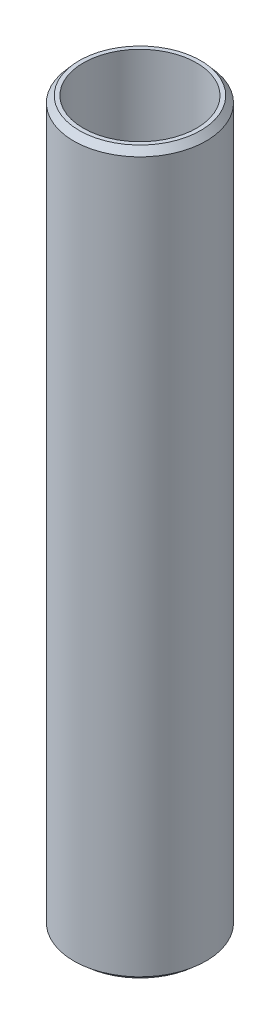
ISO-10303-21;
HEADER;
FILE_DESCRIPTION(('STEP AP214'),'2;1');
FILE_NAME('part.step','',(''),(''),'','','');
FILE_SCHEMA(('AUTOMOTIVE_DESIGN { 1 0 10303 214 1 1 1 1 }'));
ENDSEC;
DATA;
#1=APPLICATION_CONTEXT('core data for automotive mechanical design processes');
#2=APPLICATION_PROTOCOL_DEFINITION('international standard','automotive_design',2000,#1);
#3=PRODUCT_CONTEXT('',#1,'mechanical');
#4=PRODUCT('Part','Part','',(#3));
#5=PRODUCT_RELATED_PRODUCT_CATEGORY('part','',(#4));
#6=PRODUCT_DEFINITION_FORMATION('','',#4);
#7=PRODUCT_DEFINITION_CONTEXT('part definition',#1,'design');
#8=PRODUCT_DEFINITION('design','',#6,#7);
#9=PRODUCT_DEFINITION_SHAPE('','',#8);
#10=(LENGTH_UNIT() NAMED_UNIT(*) SI_UNIT(.MILLI.,.METRE.));
#11=(NAMED_UNIT(*) PLANE_ANGLE_UNIT() SI_UNIT($,.RADIAN.));
#12=(NAMED_UNIT(*) SI_UNIT($,.STERADIAN.) SOLID_ANGLE_UNIT());
#13=UNCERTAINTY_MEASURE_WITH_UNIT(LENGTH_MEASURE(1.E-05),#10,'distance_accuracy_value','');
#14=(GEOMETRIC_REPRESENTATION_CONTEXT(3) GLOBAL_UNCERTAINTY_ASSIGNED_CONTEXT((#13)) GLOBAL_UNIT_ASSIGNED_CONTEXT((#10,
#11,#12)) REPRESENTATION_CONTEXT('',''));
#15=CARTESIAN_POINT('',(0.,0.,0.));
#16=DIRECTION('',(0.,0.,1.));
#17=DIRECTION('',(1.,0.,0.));
#18=AXIS2_PLACEMENT_3D('',#15,#16,#17);
#19=CARTESIAN_POINT('',(0.,600.,0.));
#20=DIRECTION('',(0.,-1.,0.));
#21=DIRECTION('',(0.,0.,-1.));
#22=AXIS2_PLACEMENT_3D('',#19,#20,#21);
#23=CYLINDRICAL_SURFACE('',#22,55.);
#24=CARTESIAN_POINT('',(0.,594.720282676706,0.));
#25=DIRECTION('',(0.,1.,0.));
#26=DIRECTION('',(0.,0.,1.));
#27=AXIS2_PLACEMENT_3D('',#24,#25,#26);
#28=CIRCLE('',#27,55.);
#29=CARTESIAN_POINT('',(0.,594.720282676706,55.));
#30=VERTEX_POINT('',#29);
#31=EDGE_CURVE('E50',#30,#30,#28,.F.);
#32=ORIENTED_EDGE('',*,*,#31,.T.);
#33=EDGE_LOOP('',(#32));
#34=FACE_BOUND('',#33,.T.);
#35=CARTESIAN_POINT('',(0.,4.58397171619995,0.));
#36=DIRECTION('',(0.,1.,0.));
#37=DIRECTION('',(0.,0.,1.));
#38=AXIS2_PLACEMENT_3D('',#35,#36,#37);
#39=CIRCLE('',#38,55.);
#40=CARTESIAN_POINT('',(0.,4.58397171619995,55.));
#41=VERTEX_POINT('',#40);
#42=EDGE_CURVE('E51',#41,#41,#39,.T.);
#43=ORIENTED_EDGE('',*,*,#42,.T.);
#44=EDGE_LOOP('',(#43));
#45=FACE_BOUND('',#44,.T.);
#46=ADVANCED_FACE('F39',(#34,#45),#23,.T.);
#47=CARTESIAN_POINT('',(0.,600.,0.));
#48=DIRECTION('',(0.,1.,0.));
#49=DIRECTION('',(0.,0.,1.));
#50=AXIS2_PLACEMENT_3D('',#47,#48,#49);
#51=PLANE('',#50);
#52=CARTESIAN_POINT('',(0.,600.,0.));
#53=DIRECTION('',(0.,1.,0.));
#54=DIRECTION('',(0.,0.,1.));
#55=AXIS2_PLACEMENT_3D('',#52,#53,#54);
#56=CIRCLE('',#55,50.4160282838);
#57=CARTESIAN_POINT('',(0.,600.,50.4160282838));
#58=VERTEX_POINT('',#57);
#59=EDGE_CURVE('E54',#58,#58,#56,.T.);
#60=ORIENTED_EDGE('',*,*,#59,.T.);
#61=EDGE_LOOP('',(#60));
#62=FACE_BOUND('',#61,.T.);
#63=CARTESIAN_POINT('',(0.,600.,0.));
#64=DIRECTION('',(0.,1.,0.));
#65=DIRECTION('',(0.,0.,1.));
#66=AXIS2_PLACEMENT_3D('',#63,#64,#65);
#67=CIRCLE('',#66,47.0654969787981);
#68=CARTESIAN_POINT('',(0.,600.,47.0654969787981));
#69=VERTEX_POINT('',#68);
#70=EDGE_CURVE('E58',#69,#69,#67,.T.);
#71=ORIENTED_EDGE('',*,*,#70,.F.);
#72=EDGE_LOOP('',(#71));
#73=FACE_BOUND('',#72,.T.);
#74=ADVANCED_FACE('F69',(#62,#73),#51,.T.);
#75=CARTESIAN_POINT('',(0.,0.,0.));
#76=DIRECTION('',(0.,1.,0.));
#77=DIRECTION('',(0.,0.,1.));
#78=AXIS2_PLACEMENT_3D('',#75,#76,#77);
#79=PLANE('',#78);
#80=CARTESIAN_POINT('',(0.,0.,0.));
#81=DIRECTION('',(0.,1.,0.));
#82=DIRECTION('',(0.,0.,1.));
#83=AXIS2_PLACEMENT_3D('',#80,#81,#82);
#84=CIRCLE('',#83,49.7202826767062);
#85=CARTESIAN_POINT('',(0.,0.,49.7202826767062));
#86=VERTEX_POINT('',#85);
#87=EDGE_CURVE('E10',#86,#86,#84,.F.);
#88=ORIENTED_EDGE('',*,*,#87,.T.);
#89=EDGE_LOOP('',(#88));
#90=FACE_BOUND('',#89,.T.);
#91=CARTESIAN_POINT('',(0.,0.,0.));
#92=DIRECTION('',(0.,1.,0.));
#93=DIRECTION('',(0.,0.,1.));
#94=AXIS2_PLACEMENT_3D('',#91,#92,#93);
#95=CIRCLE('',#94,47.0654969787981);
#96=CARTESIAN_POINT('',(0.,0.,47.0654969787981));
#97=VERTEX_POINT('',#96);
#98=EDGE_CURVE('E63',#97,#97,#95,.T.);
#99=ORIENTED_EDGE('',*,*,#98,.T.);
#100=EDGE_LOOP('',(#99));
#101=FACE_BOUND('',#100,.T.);
#102=ADVANCED_FACE('F75',(#90,#101),#79,.F.);
#103=CARTESIAN_POINT('',(0.,600.,0.));
#104=DIRECTION('',(0.,-1.,0.));
#105=DIRECTION('',(0.,0.,-1.));
#106=AXIS2_PLACEMENT_3D('',#103,#104,#105);
#107=CYLINDRICAL_SURFACE('',#106,47.0654969787981);
#108=ORIENTED_EDGE('',*,*,#70,.T.);
#109=EDGE_LOOP('',(#108));
#110=FACE_BOUND('',#109,.T.);
#111=ORIENTED_EDGE('',*,*,#98,.F.);
#112=EDGE_LOOP('',(#111));
#113=FACE_BOUND('',#112,.T.);
#114=ADVANCED_FACE('F70',(#110,#113),#107,.F.);
#115=CARTESIAN_POINT('',(0.,600.,0.));
#116=DIRECTION('',(0.,-1.,0.));
#117=DIRECTION('',(0.,0.,-1.));
#118=AXIS2_PLACEMENT_3D('',#115,#116,#117);
#119=CONICAL_SURFACE('',#118,50.4160282838,0.714978751236127);
#120=ORIENTED_EDGE('',*,*,#31,.F.);
#121=EDGE_LOOP('',(#120));
#122=FACE_BOUND('',#121,.T.);
#123=ORIENTED_EDGE('',*,*,#59,.F.);
#124=EDGE_LOOP('',(#123));
#125=FACE_BOUND('',#124,.T.);
#126=ADVANCED_FACE('F81',(#122,#125),#119,.T.);
#127=CARTESIAN_POINT('',(0.,4.58397171619995,0.));
#128=DIRECTION('',(0.,1.,0.));
#129=DIRECTION('',(0.,0.,1.));
#130=AXIS2_PLACEMENT_3D('',#127,#128,#129);
#131=CONICAL_SURFACE('',#130,55.,0.855817575558777);
#132=ORIENTED_EDGE('',*,*,#87,.F.);
#133=EDGE_LOOP('',(#132));
#134=FACE_BOUND('',#133,.T.);
#135=ORIENTED_EDGE('',*,*,#42,.F.);
#136=EDGE_LOOP('',(#135));
#137=FACE_BOUND('',#136,.T.);
#138=ADVANCED_FACE('F45',(#134,#137),#131,.T.);
#139=CLOSED_SHELL('',(#46,#74,#102,#114,#126,#138));
#140=MANIFOLD_SOLID_BREP('B2',#139);
#141=ADVANCED_BREP_SHAPE_REPRESENTATION('',(#18,#140),#14);
#142=SHAPE_DEFINITION_REPRESENTATION(#9,#141);
ENDSEC;
END-ISO-10303-21;
